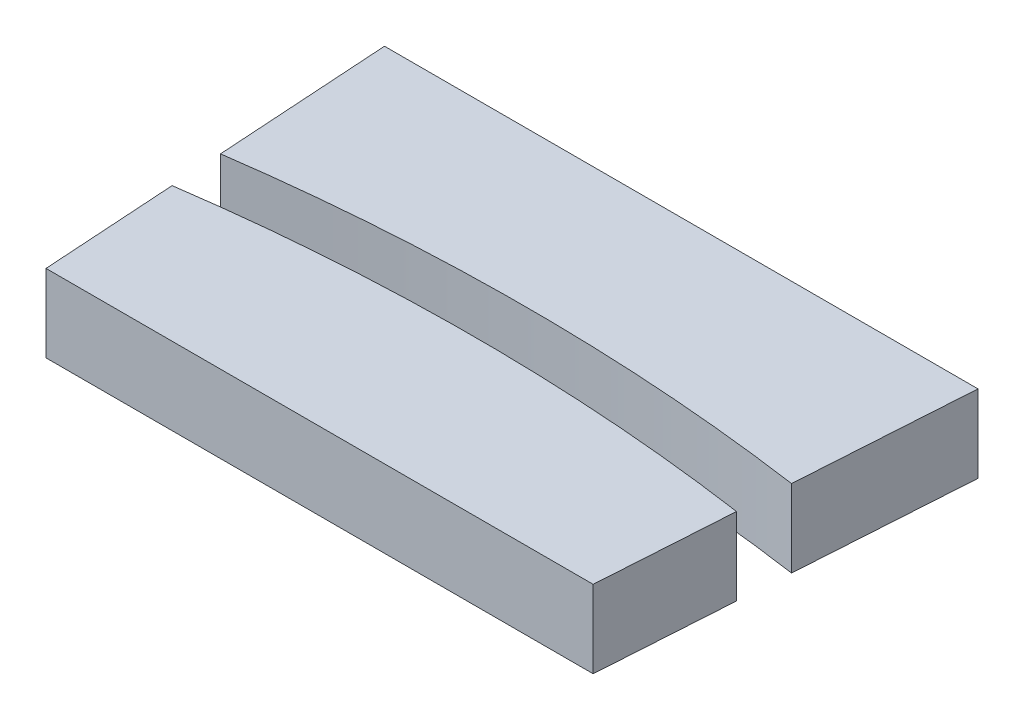
ISO-10303-21;
HEADER;
FILE_DESCRIPTION(('STEP AP214'),'2;1');
FILE_NAME('part.step','',(''),(''),'','','');
FILE_SCHEMA(('AUTOMOTIVE_DESIGN { 1 0 10303 214 1 1 1 1 }'));
ENDSEC;
DATA;
#1=APPLICATION_CONTEXT('core data for automotive mechanical design processes');
#2=APPLICATION_PROTOCOL_DEFINITION('international standard','automotive_design',2000,#1);
#3=PRODUCT_CONTEXT('',#1,'mechanical');
#4=PRODUCT('Part','Part','',(#3));
#5=PRODUCT_RELATED_PRODUCT_CATEGORY('part','',(#4));
#6=PRODUCT_DEFINITION_FORMATION('','',#4);
#7=PRODUCT_DEFINITION_CONTEXT('part definition',#1,'design');
#8=PRODUCT_DEFINITION('design','',#6,#7);
#9=PRODUCT_DEFINITION_SHAPE('','',#8);
#10=(LENGTH_UNIT() NAMED_UNIT(*) SI_UNIT(.MILLI.,.METRE.));
#11=(NAMED_UNIT(*) PLANE_ANGLE_UNIT() SI_UNIT($,.RADIAN.));
#12=(NAMED_UNIT(*) SI_UNIT($,.STERADIAN.) SOLID_ANGLE_UNIT());
#13=UNCERTAINTY_MEASURE_WITH_UNIT(LENGTH_MEASURE(1.E-05),#10,'distance_accuracy_value','');
#14=(GEOMETRIC_REPRESENTATION_CONTEXT(3) GLOBAL_UNCERTAINTY_ASSIGNED_CONTEXT((#13)) GLOBAL_UNIT_ASSIGNED_CONTEXT((#10,
#11,#12)) REPRESENTATION_CONTEXT('',''));
#15=CARTESIAN_POINT('',(0.,0.,0.));
#16=DIRECTION('',(0.,0.,1.));
#17=DIRECTION('',(1.,0.,0.));
#18=AXIS2_PLACEMENT_3D('',#15,#16,#17);
#19=CARTESIAN_POINT('',(-10.0775126467332,3.,-62.5));
#20=DIRECTION('',(0.997952992766008,0.,-0.0639517335915789));
#21=DIRECTION('',(-0.0639517335915789,0.,-0.997952992766008));
#22=AXIS2_PLACEMENT_3D('',#19,#20,#21);
#23=PLANE('',#22);
#24=DIRECTION('',(0.0639517335915789,0.,0.997952992766008));
#25=VECTOR('',#24,1.);
#26=CARTESIAN_POINT('',(-10.0775126467332,0.,-62.5));
#27=LINE('',#26,#25);
#28=CARTESIAN_POINT('',(-11.4873367057955,0.,-84.5));
#29=VERTEX_POINT('',#28);
#30=CARTESIAN_POINT('',(-11.0527262817641,0.,-77.7179981840783));
#31=VERTEX_POINT('',#30);
#32=EDGE_CURVE('E103',#29,#31,#27,.T.);
#33=ORIENTED_EDGE('',*,*,#32,.T.);
#34=DIRECTION('',(0.,1.,0.));
#35=VECTOR('',#34,1.);
#36=CARTESIAN_POINT('',(-11.0527262817641,0.,-77.7179981840783));
#37=LINE('',#36,#35);
#38=CARTESIAN_POINT('',(-11.0527262817641,3.,-77.7179981840783));
#39=VERTEX_POINT('',#38);
#40=EDGE_CURVE('E59',#31,#39,#37,.T.);
#41=ORIENTED_EDGE('',*,*,#40,.T.);
#42=DIRECTION('',(0.0639517335915789,0.,0.997952992766008));
#43=VECTOR('',#42,1.);
#44=CARTESIAN_POINT('',(-10.0775126467332,3.,-62.5));
#45=LINE('',#44,#43);
#46=CARTESIAN_POINT('',(-11.4873367057955,3.,-84.5));
#47=VERTEX_POINT('',#46);
#48=EDGE_CURVE('E105',#47,#39,#45,.T.);
#49=ORIENTED_EDGE('',*,*,#48,.F.);
#50=DIRECTION('',(0.,1.,0.));
#51=VECTOR('',#50,1.);
#52=CARTESIAN_POINT('',(-11.4873367057955,0.,-84.5));
#53=LINE('',#52,#51);
#54=EDGE_CURVE('E51',#29,#47,#53,.T.);
#55=ORIENTED_EDGE('',*,*,#54,.F.);
#56=EDGE_LOOP('',(#33,#41,#49,#55));
#57=FACE_BOUND('',#56,.T.);
#58=ADVANCED_FACE('F43',(#57),#23,.F.);
#59=CARTESIAN_POINT('',(0.,3.,0.));
#60=DIRECTION('',(0.,-1.,0.));
#61=DIRECTION('',(0.,0.,-1.));
#62=AXIS2_PLACEMENT_3D('',#59,#60,#61);
#63=PLANE('',#62);
#64=ORIENTED_EDGE('',*,*,#48,.T.);
#65=CARTESIAN_POINT('',(0.,3.,0.));
#66=DIRECTION('',(0.,-1.,0.));
#67=DIRECTION('',(0.,0.,-1.));
#68=AXIS2_PLACEMENT_3D('',#65,#66,#67);
#69=CIRCLE('',#68,78.5);
#70=CARTESIAN_POINT('',(11.0527262817641,3.000006,-77.7179981840783));
#71=VERTEX_POINT('',#70);
#72=EDGE_CURVE('E63',#39,#71,#69,.T.);
#73=ORIENTED_EDGE('',*,*,#72,.T.);
#74=DIRECTION('',(-0.0639517335915789,0.,0.997952992766008));
#75=VECTOR('',#74,1.);
#76=CARTESIAN_POINT('',(10.0775126467332,3.,-62.5));
#77=LINE('',#76,#75);
#78=CARTESIAN_POINT('',(11.4873367057955,3.,-84.5));
#79=VERTEX_POINT('',#78);
#80=EDGE_CURVE('E96',#79,#71,#77,.T.);
#81=ORIENTED_EDGE('',*,*,#80,.F.);
#82=DIRECTION('',(-1.,0.,0.));
#83=VECTOR('',#82,1.);
#84=CARTESIAN_POINT('',(0.,3.,-84.5));
#85=LINE('',#84,#83);
#86=EDGE_CURVE('E87',#79,#47,#85,.T.);
#87=ORIENTED_EDGE('',*,*,#86,.T.);
#88=EDGE_LOOP('',(#64,#73,#81,#87));
#89=FACE_BOUND('',#88,.T.);
#90=ADVANCED_FACE('F123',(#89),#63,.F.);
#91=CARTESIAN_POINT('',(0.,0.,0.));
#92=DIRECTION('',(0.,-1.,0.));
#93=DIRECTION('',(0.,0.,-1.));
#94=AXIS2_PLACEMENT_3D('',#91,#92,#93);
#95=PLANE('',#94);
#96=CARTESIAN_POINT('',(0.,0.,0.));
#97=DIRECTION('',(0.,1.,0.));
#98=DIRECTION('',(0.,0.,-1.));
#99=AXIS2_PLACEMENT_3D('',#96,#97,#98);
#100=CIRCLE('',#99,78.5);
#101=CARTESIAN_POINT('',(11.0527262817641,0.,-77.7179981840783));
#102=VERTEX_POINT('',#101);
#103=EDGE_CURVE('E79',#102,#31,#100,.T.);
#104=ORIENTED_EDGE('',*,*,#103,.T.);
#105=ORIENTED_EDGE('',*,*,#32,.F.);
#106=DIRECTION('',(1.,0.,0.));
#107=VECTOR('',#106,1.);
#108=CARTESIAN_POINT('',(11.4873367057955,0.,-84.5));
#109=LINE('',#108,#107);
#110=CARTESIAN_POINT('',(11.4873367057955,0.,-84.5));
#111=VERTEX_POINT('',#110);
#112=EDGE_CURVE('E86',#29,#111,#109,.T.);
#113=ORIENTED_EDGE('',*,*,#112,.T.);
#114=DIRECTION('',(-0.0639517335915789,0.,0.997952992766008));
#115=VECTOR('',#114,1.);
#116=CARTESIAN_POINT('',(10.0775126467332,0.,-62.5));
#117=LINE('',#116,#115);
#118=EDGE_CURVE('E94',#111,#102,#117,.T.);
#119=ORIENTED_EDGE('',*,*,#118,.T.);
#120=EDGE_LOOP('',(#104,#105,#113,#119));
#121=FACE_BOUND('',#120,.T.);
#122=ADVANCED_FACE('F98',(#121),#95,.T.);
#123=CARTESIAN_POINT('',(10.0775126467332,3.,-62.5));
#124=DIRECTION('',(0.997952992766008,0.,0.0639517335915789));
#125=DIRECTION('',(0.0639517335915789,0.,-0.997952992766008));
#126=AXIS2_PLACEMENT_3D('',#123,#124,#125);
#127=PLANE('',#126);
#128=DIRECTION('',(0.,1.,0.));
#129=VECTOR('',#128,1.);
#130=CARTESIAN_POINT('',(11.0527262817641,0.,-77.7179981840783));
#131=LINE('',#130,#129);
#132=EDGE_CURVE('E12',#102,#71,#131,.T.);
#133=ORIENTED_EDGE('',*,*,#132,.F.);
#134=ORIENTED_EDGE('',*,*,#118,.F.);
#135=DIRECTION('',(0.,1.,0.));
#136=VECTOR('',#135,1.);
#137=CARTESIAN_POINT('',(11.4873367057955,0.,-84.5));
#138=LINE('',#137,#136);
#139=EDGE_CURVE('E99',#111,#79,#138,.T.);
#140=ORIENTED_EDGE('',*,*,#139,.T.);
#141=ORIENTED_EDGE('',*,*,#80,.T.);
#142=EDGE_LOOP('',(#133,#134,#140,#141));
#143=FACE_BOUND('',#142,.T.);
#144=ADVANCED_FACE('F92',(#143),#127,.T.);
#145=CARTESIAN_POINT('',(11.4873367057955,0.,-84.5));
#146=DIRECTION('',(0.,0.,1.));
#147=DIRECTION('',(1.,0.,0.));
#148=AXIS2_PLACEMENT_3D('',#145,#146,#147);
#149=PLANE('',#148);
#150=ORIENTED_EDGE('',*,*,#139,.F.);
#151=ORIENTED_EDGE('',*,*,#112,.F.);
#152=ORIENTED_EDGE('',*,*,#54,.T.);
#153=ORIENTED_EDGE('',*,*,#86,.F.);
#154=EDGE_LOOP('',(#150,#151,#152,#153));
#155=FACE_BOUND('',#154,.T.);
#156=ADVANCED_FACE('F119',(#155),#149,.F.);
#157=CARTESIAN_POINT('',(0.,0.,0.));
#158=DIRECTION('',(0.,1.,0.));
#159=DIRECTION('',(0.,0.,1.));
#160=AXIS2_PLACEMENT_3D('',#157,#158,#159);
#161=CYLINDRICAL_SURFACE('',#160,78.5);
#162=ORIENTED_EDGE('',*,*,#103,.F.);
#163=ORIENTED_EDGE('',*,*,#132,.T.);
#164=ORIENTED_EDGE('',*,*,#72,.F.);
#165=ORIENTED_EDGE('',*,*,#40,.F.);
#166=EDGE_LOOP('',(#162,#163,#164,#165));
#167=FACE_BOUND('',#166,.T.);
#168=ADVANCED_FACE('F81',(#167),#161,.F.);
#169=CLOSED_SHELL('',(#58,#90,#122,#144,#156,#168));
#170=MANIFOLD_SOLID_BREP('B2',#169);
#171=CARTESIAN_POINT('',(-10.5901759409377,0.,-70.5));
#172=DIRECTION('',(0.,0.,-1.));
#173=DIRECTION('',(-1.,0.,0.));
#174=AXIS2_PLACEMENT_3D('',#171,#172,#173);
#175=PLANE('',#174);
#176=DIRECTION('',(0.,1.,0.));
#177=VECTOR('',#176,1.);
#178=CARTESIAN_POINT('',(-10.5901759409377,0.,-70.5));
#179=LINE('',#178,#177);
#180=CARTESIAN_POINT('',(-10.5901759409377,0.,-70.5));
#181=VERTEX_POINT('',#180);
#182=CARTESIAN_POINT('',(-10.5901759409377,3.,-70.5));
#183=VERTEX_POINT('',#182);
#184=EDGE_CURVE('E234',#181,#183,#179,.T.);
#185=ORIENTED_EDGE('',*,*,#184,.F.);
#186=DIRECTION('',(-1.,0.,0.));
#187=VECTOR('',#186,1.);
#188=CARTESIAN_POINT('',(-10.5901759409377,0.,-70.5));
#189=LINE('',#188,#187);
#190=CARTESIAN_POINT('',(10.5901759409377,0.,-70.5));
#191=VERTEX_POINT('',#190);
#192=EDGE_CURVE('E240',#191,#181,#189,.T.);
#193=ORIENTED_EDGE('',*,*,#192,.F.);
#194=DIRECTION('',(0.,1.,0.));
#195=VECTOR('',#194,1.);
#196=CARTESIAN_POINT('',(10.5901759409377,0.,-70.5));
#197=LINE('',#196,#195);
#198=CARTESIAN_POINT('',(10.5901759409377,3.,-70.5));
#199=VERTEX_POINT('',#198);
#200=EDGE_CURVE('E236',#191,#199,#197,.T.);
#201=ORIENTED_EDGE('',*,*,#200,.T.);
#202=DIRECTION('',(1.,0.,0.));
#203=VECTOR('',#202,1.);
#204=CARTESIAN_POINT('',(0.,3.,-70.5));
#205=LINE('',#204,#203);
#206=EDGE_CURVE('E228',#183,#199,#205,.T.);
#207=ORIENTED_EDGE('',*,*,#206,.F.);
#208=EDGE_LOOP('',(#185,#193,#201,#207));
#209=FACE_BOUND('',#208,.T.);
#210=ADVANCED_FACE('F179',(#209),#175,.F.);
#211=CARTESIAN_POINT('',(10.0775126467332,3.,-62.5));
#212=DIRECTION('',(0.997952992766008,0.,0.0639517335915789));
#213=DIRECTION('',(0.0639517335915789,0.,-0.997952992766008));
#214=AXIS2_PLACEMENT_3D('',#211,#212,#213);
#215=PLANE('',#214);
#216=DIRECTION('',(0.,1.,0.));
#217=VECTOR('',#216,1.);
#218=CARTESIAN_POINT('',(10.9244299434883,0.,-75.7159615299827));
#219=LINE('',#218,#217);
#220=CARTESIAN_POINT('',(10.9244299434883,0.,-75.7159615299827));
#221=VERTEX_POINT('',#220);
#222=CARTESIAN_POINT('',(10.9244299434883,3.,-75.7159615299827));
#223=VERTEX_POINT('',#222);
#224=EDGE_CURVE('E220',#221,#223,#219,.T.);
#225=ORIENTED_EDGE('',*,*,#224,.T.);
#226=DIRECTION('',(-0.0639517335915789,0.,0.997952992766008));
#227=VECTOR('',#226,1.);
#228=CARTESIAN_POINT('',(10.0775126467332,3.,-62.5));
#229=LINE('',#228,#227);
#230=EDGE_CURVE('E245',#223,#199,#229,.T.);
#231=ORIENTED_EDGE('',*,*,#230,.T.);
#232=ORIENTED_EDGE('',*,*,#200,.F.);
#233=DIRECTION('',(-0.0639517335915789,0.,0.997952992766008));
#234=VECTOR('',#233,1.);
#235=CARTESIAN_POINT('',(10.0775126467332,0.,-62.5));
#236=LINE('',#235,#234);
#237=EDGE_CURVE('E204',#221,#191,#236,.T.);
#238=ORIENTED_EDGE('',*,*,#237,.F.);
#239=EDGE_LOOP('',(#225,#231,#232,#238));
#240=FACE_BOUND('',#239,.T.);
#241=ADVANCED_FACE('F248',(#240),#215,.T.);
#242=CARTESIAN_POINT('',(0.,0.,0.));
#243=DIRECTION('',(0.,-1.,0.));
#244=DIRECTION('',(0.,0.,-1.));
#245=AXIS2_PLACEMENT_3D('',#242,#243,#244);
#246=PLANE('',#245);
#247=CARTESIAN_POINT('',(0.,0.,0.));
#248=DIRECTION('',(0.,-1.,0.));
#249=DIRECTION('',(0.,0.,-1.));
#250=AXIS2_PLACEMENT_3D('',#247,#248,#249);
#251=CIRCLE('',#250,76.5);
#252=CARTESIAN_POINT('',(-10.9244299434883,0.,-75.7159615299827));
#253=VERTEX_POINT('',#252);
#254=EDGE_CURVE('E250',#253,#221,#251,.T.);
#255=ORIENTED_EDGE('',*,*,#254,.T.);
#256=ORIENTED_EDGE('',*,*,#237,.T.);
#257=ORIENTED_EDGE('',*,*,#192,.T.);
#258=DIRECTION('',(0.0639517335915789,0.,0.997952992766008));
#259=VECTOR('',#258,1.);
#260=CARTESIAN_POINT('',(-10.0775126467332,0.,-62.5));
#261=LINE('',#260,#259);
#262=EDGE_CURVE('E188',#253,#181,#261,.T.);
#263=ORIENTED_EDGE('',*,*,#262,.F.);
#264=EDGE_LOOP('',(#255,#256,#257,#263));
#265=FACE_BOUND('',#264,.T.);
#266=ADVANCED_FACE('F252',(#265),#246,.T.);
#267=CARTESIAN_POINT('',(0.,3.,0.));
#268=DIRECTION('',(0.,-1.,0.));
#269=DIRECTION('',(0.,0.,-1.));
#270=AXIS2_PLACEMENT_3D('',#267,#268,#269);
#271=PLANE('',#270);
#272=ORIENTED_EDGE('',*,*,#230,.F.);
#273=CARTESIAN_POINT('',(0.,3.,0.));
#274=DIRECTION('',(0.,1.,0.));
#275=DIRECTION('',(0.,0.,1.));
#276=AXIS2_PLACEMENT_3D('',#273,#274,#275);
#277=CIRCLE('',#276,76.5);
#278=CARTESIAN_POINT('',(-10.9244299434883,3.,-75.7159615299827));
#279=VERTEX_POINT('',#278);
#280=EDGE_CURVE('E183',#279,#223,#277,.F.);
#281=ORIENTED_EDGE('',*,*,#280,.F.);
#282=DIRECTION('',(0.0639517335915789,0.,0.997952992766008));
#283=VECTOR('',#282,1.);
#284=CARTESIAN_POINT('',(-10.0775126467332,3.,-62.5));
#285=LINE('',#284,#283);
#286=EDGE_CURVE('E41',#279,#183,#285,.T.);
#287=ORIENTED_EDGE('',*,*,#286,.T.);
#288=ORIENTED_EDGE('',*,*,#206,.T.);
#289=EDGE_LOOP('',(#272,#281,#287,#288));
#290=FACE_BOUND('',#289,.T.);
#291=ADVANCED_FACE('F227',(#290),#271,.F.);
#292=CARTESIAN_POINT('',(-10.0775126467332,3.,-62.5));
#293=DIRECTION('',(0.997952992766008,0.,-0.0639517335915789));
#294=DIRECTION('',(-0.0639517335915789,0.,-0.997952992766008));
#295=AXIS2_PLACEMENT_3D('',#292,#293,#294);
#296=PLANE('',#295);
#297=ORIENTED_EDGE('',*,*,#286,.F.);
#298=DIRECTION('',(0.,1.,0.));
#299=VECTOR('',#298,1.);
#300=CARTESIAN_POINT('',(-10.9244299434883,0.,-75.7159615299827));
#301=LINE('',#300,#299);
#302=EDGE_CURVE('E215',#253,#279,#301,.T.);
#303=ORIENTED_EDGE('',*,*,#302,.F.);
#304=ORIENTED_EDGE('',*,*,#262,.T.);
#305=ORIENTED_EDGE('',*,*,#184,.T.);
#306=EDGE_LOOP('',(#297,#303,#304,#305));
#307=FACE_BOUND('',#306,.T.);
#308=ADVANCED_FACE('F181',(#307),#296,.F.);
#309=CARTESIAN_POINT('',(0.,0.,0.));
#310=DIRECTION('',(0.,1.,0.));
#311=DIRECTION('',(0.,0.,1.));
#312=AXIS2_PLACEMENT_3D('',#309,#310,#311);
#313=CYLINDRICAL_SURFACE('',#312,76.5);
#314=ORIENTED_EDGE('',*,*,#224,.F.);
#315=ORIENTED_EDGE('',*,*,#254,.F.);
#316=ORIENTED_EDGE('',*,*,#302,.T.);
#317=ORIENTED_EDGE('',*,*,#280,.T.);
#318=EDGE_LOOP('',(#314,#315,#316,#317));
#319=FACE_BOUND('',#318,.T.);
#320=ADVANCED_FACE('F253',(#319),#313,.T.);
#321=CLOSED_SHELL('',(#210,#241,#266,#291,#308,#320));
#322=MANIFOLD_SOLID_BREP('B6',#321);
#323=ADVANCED_BREP_SHAPE_REPRESENTATION('',(#18,#170,#322),#14);
#324=SHAPE_DEFINITION_REPRESENTATION(#9,#323);
ENDSEC;
END-ISO-10303-21;
